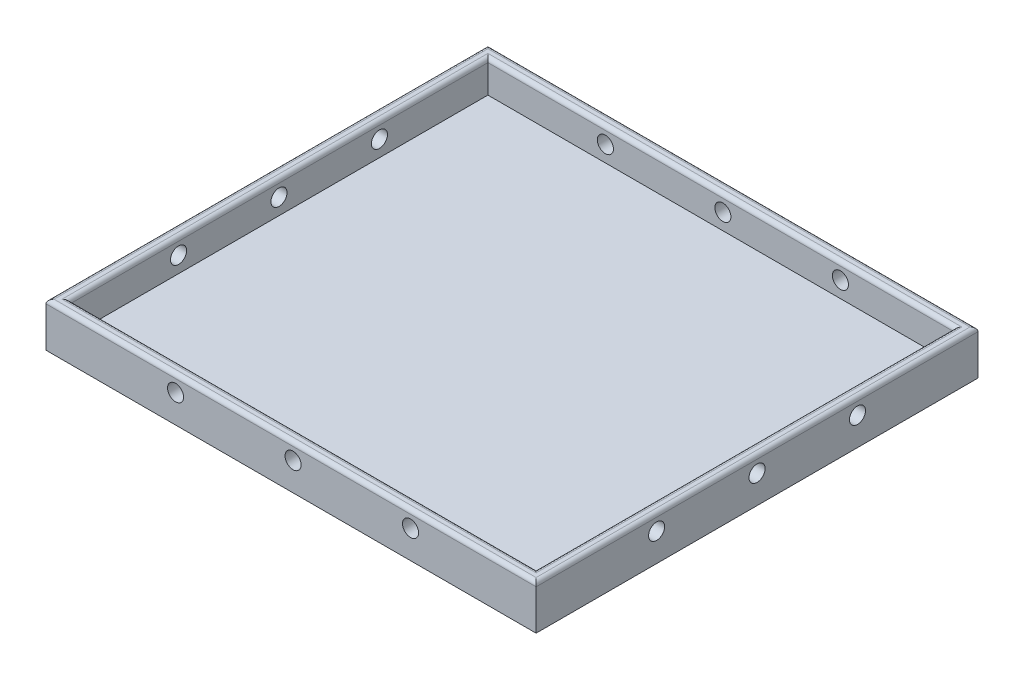
ISO-10303-21;
HEADER;
FILE_DESCRIPTION(('STEP AP214'),'2;1');
FILE_NAME('part.step','',(''),(''),'','','');
FILE_SCHEMA(('AUTOMOTIVE_DESIGN { 1 0 10303 214 1 1 1 1 }'));
ENDSEC;
DATA;
#1=APPLICATION_CONTEXT('core data for automotive mechanical design processes');
#2=APPLICATION_PROTOCOL_DEFINITION('international standard','automotive_design',2000,#1);
#3=PRODUCT_CONTEXT('',#1,'mechanical');
#4=PRODUCT('Part','Part','',(#3));
#5=PRODUCT_RELATED_PRODUCT_CATEGORY('part','',(#4));
#6=PRODUCT_DEFINITION_FORMATION('','',#4);
#7=PRODUCT_DEFINITION_CONTEXT('part definition',#1,'design');
#8=PRODUCT_DEFINITION('design','',#6,#7);
#9=PRODUCT_DEFINITION_SHAPE('','',#8);
#10=(LENGTH_UNIT() NAMED_UNIT(*) SI_UNIT(.MILLI.,.METRE.));
#11=(NAMED_UNIT(*) PLANE_ANGLE_UNIT() SI_UNIT($,.RADIAN.));
#12=(NAMED_UNIT(*) SI_UNIT($,.STERADIAN.) SOLID_ANGLE_UNIT());
#13=UNCERTAINTY_MEASURE_WITH_UNIT(LENGTH_MEASURE(1.E-05),#10,'distance_accuracy_value','');
#14=(GEOMETRIC_REPRESENTATION_CONTEXT(3) GLOBAL_UNCERTAINTY_ASSIGNED_CONTEXT((#13)) GLOBAL_UNIT_ASSIGNED_CONTEXT((#10,
#11,#12)) REPRESENTATION_CONTEXT('',''));
#15=CARTESIAN_POINT('',(0.,0.,0.));
#16=DIRECTION('',(0.,0.,1.));
#17=DIRECTION('',(1.,0.,0.));
#18=AXIS2_PLACEMENT_3D('',#15,#16,#17);
#19=CARTESIAN_POINT('',(-201.609907120743,11.,-77.8947368421052));
#20=DIRECTION('',(1.,0.,0.));
#21=DIRECTION('',(0.,0.,-1.));
#22=AXIS2_PLACEMENT_3D('',#19,#20,#21);
#23=PLANE('',#22);
#24=CARTESIAN_POINT('',(-201.609907120743,6.99999997663109,2.10526315789477));
#25=DIRECTION('',(1.,0.,0.));
#26=DIRECTION('',(0.,0.,-1.));
#27=AXIS2_PLACEMENT_3D('',#24,#25,#26);
#28=CIRCLE('',#27,1.99999999316759);
#29=CARTESIAN_POINT('',(-201.609907120743,6.99999997663109,0.105263164727173));
#30=VERTEX_POINT('',#29);
#31=EDGE_CURVE('E190',#30,#30,#28,.T.);
#32=ORIENTED_EDGE('',*,*,#31,.T.);
#33=EDGE_LOOP('',(#32));
#34=FACE_BOUND('',#33,.T.);
#35=CARTESIAN_POINT('',(-201.609907120743,6.99999997663109,-22.8947368421052));
#36=DIRECTION('',(1.,0.,0.));
#37=DIRECTION('',(0.,0.,-1.));
#38=AXIS2_PLACEMENT_3D('',#35,#36,#37);
#39=CIRCLE('',#38,1.9999999931676);
#40=CARTESIAN_POINT('',(-201.609907120743,6.99999997663109,-24.8947368352728));
#41=VERTEX_POINT('',#40);
#42=EDGE_CURVE('E593',#41,#41,#39,.T.);
#43=ORIENTED_EDGE('',*,*,#42,.T.);
#44=EDGE_LOOP('',(#43));
#45=FACE_BOUND('',#44,.T.);
#46=CARTESIAN_POINT('',(-201.609907120743,7.,-47.8947368421052));
#47=DIRECTION('',(1.,0.,0.));
#48=DIRECTION('',(0.,0.,-1.));
#49=AXIS2_PLACEMENT_3D('',#46,#47,#48);
#50=CIRCLE('',#49,2.);
#51=CARTESIAN_POINT('',(-201.609907120743,7.,-49.8947368421052));
#52=VERTEX_POINT('',#51);
#53=EDGE_CURVE('E586',#52,#52,#50,.T.);
#54=ORIENTED_EDGE('',*,*,#53,.T.);
#55=EDGE_LOOP('',(#54));
#56=FACE_BOUND('',#55,.T.);
#57=DIRECTION('',(0.,-1.,0.));
#58=VECTOR('',#57,1.);
#59=CARTESIAN_POINT('',(-201.609907120743,11.,32.1052631578948));
#60=LINE('',#59,#58);
#61=CARTESIAN_POINT('',(-201.609907120743,10.,32.1052631578948));
#62=VERTEX_POINT('',#61);
#63=CARTESIAN_POINT('',(-201.609907120743,0.,32.1052631578948));
#64=VERTEX_POINT('',#63);
#65=EDGE_CURVE('E183',#62,#64,#60,.T.);
#66=ORIENTED_EDGE('',*,*,#65,.F.);
#67=DIRECTION('',(0.,0.,1.));
#68=VECTOR('',#67,1.);
#69=CARTESIAN_POINT('',(-201.609907120743,10.,-77.8947368421052));
#70=LINE('',#69,#68);
#71=CARTESIAN_POINT('',(-201.609907120743,10.,-77.8947368421052));
#72=VERTEX_POINT('',#71);
#73=EDGE_CURVE('E44',#62,#72,#70,.F.);
#74=ORIENTED_EDGE('',*,*,#73,.T.);
#75=DIRECTION('',(0.,-1.,0.));
#76=VECTOR('',#75,1.);
#77=CARTESIAN_POINT('',(-201.609907120743,11.,-77.8947368421052));
#78=LINE('',#77,#76);
#79=CARTESIAN_POINT('',(-201.609907120743,0.,-77.8947368421052));
#80=VERTEX_POINT('',#79);
#81=EDGE_CURVE('E177',#72,#80,#78,.T.);
#82=ORIENTED_EDGE('',*,*,#81,.T.);
#83=DIRECTION('',(0.,0.,1.));
#84=VECTOR('',#83,1.);
#85=CARTESIAN_POINT('',(-201.609907120743,0.,-77.8947368421052));
#86=LINE('',#85,#84);
#87=EDGE_CURVE('E162',#80,#64,#86,.T.);
#88=ORIENTED_EDGE('',*,*,#87,.T.);
#89=EDGE_LOOP('',(#66,#74,#82,#88));
#90=FACE_BOUND('',#89,.T.);
#91=ADVANCED_FACE('F35',(#34,#45,#56,#90),#23,.F.);
#92=CARTESIAN_POINT('',(-201.609907120743,11.,32.1052631578948));
#93=DIRECTION('',(0.,0.,-1.));
#94=DIRECTION('',(-1.,0.,0.));
#95=AXIS2_PLACEMENT_3D('',#92,#93,#94);
#96=PLANE('',#95);
#97=CARTESIAN_POINT('',(-169.359907120743,7.,32.1052631578948));
#98=DIRECTION('',(0.,0.,1.));
#99=DIRECTION('',(1.,0.,0.));
#100=AXIS2_PLACEMENT_3D('',#97,#98,#99);
#101=CIRCLE('',#100,2.);
#102=CARTESIAN_POINT('',(-167.359907120743,7.,32.1052631578948));
#103=VERTEX_POINT('',#102);
#104=EDGE_CURVE('E621',#103,#103,#101,.T.);
#105=ORIENTED_EDGE('',*,*,#104,.F.);
#106=EDGE_LOOP('',(#105));
#107=FACE_BOUND('',#106,.T.);
#108=CARTESIAN_POINT('',(-140.109907120743,7.,32.1052631578948));
#109=DIRECTION('',(0.,0.,1.));
#110=DIRECTION('',(1.,0.,0.));
#111=AXIS2_PLACEMENT_3D('',#108,#109,#110);
#112=CIRCLE('',#111,2.);
#113=CARTESIAN_POINT('',(-138.109907120743,7.,32.1052631578948));
#114=VERTEX_POINT('',#113);
#115=EDGE_CURVE('E615',#114,#114,#112,.T.);
#116=ORIENTED_EDGE('',*,*,#115,.F.);
#117=EDGE_LOOP('',(#116));
#118=FACE_BOUND('',#117,.T.);
#119=CARTESIAN_POINT('',(-110.859907120743,7.,32.1052631578948));
#120=DIRECTION('',(0.,0.,1.));
#121=DIRECTION('',(1.,0.,0.));
#122=AXIS2_PLACEMENT_3D('',#119,#120,#121);
#123=CIRCLE('',#122,2.);
#124=CARTESIAN_POINT('',(-108.859907120743,7.,32.1052631578948));
#125=VERTEX_POINT('',#124);
#126=EDGE_CURVE('E249',#125,#125,#123,.T.);
#127=ORIENTED_EDGE('',*,*,#126,.F.);
#128=EDGE_LOOP('',(#127));
#129=FACE_BOUND('',#128,.T.);
#130=DIRECTION('',(0.,-1.,0.));
#131=VECTOR('',#130,1.);
#132=CARTESIAN_POINT('',(-79.6099071207431,11.,32.1052631578948));
#133=LINE('',#132,#131);
#134=CARTESIAN_POINT('',(-79.6099071207431,10.,32.1052631578948));
#135=VERTEX_POINT('',#134);
#136=CARTESIAN_POINT('',(-79.6099071207431,0.,32.1052631578948));
#137=VERTEX_POINT('',#136);
#138=EDGE_CURVE('E181',#135,#137,#133,.T.);
#139=ORIENTED_EDGE('',*,*,#138,.F.);
#140=DIRECTION('',(1.,0.,0.));
#141=VECTOR('',#140,1.);
#142=CARTESIAN_POINT('',(-201.609907120743,10.,32.1052631578948));
#143=LINE('',#142,#141);
#144=EDGE_CURVE('E229',#135,#62,#143,.F.);
#145=ORIENTED_EDGE('',*,*,#144,.T.);
#146=ORIENTED_EDGE('',*,*,#65,.T.);
#147=DIRECTION('',(1.,0.,0.));
#148=VECTOR('',#147,1.);
#149=CARTESIAN_POINT('',(-201.609907120743,0.,32.1052631578948));
#150=LINE('',#149,#148);
#151=EDGE_CURVE('E168',#64,#137,#150,.T.);
#152=ORIENTED_EDGE('',*,*,#151,.T.);
#153=EDGE_LOOP('',(#139,#145,#146,#152));
#154=FACE_BOUND('',#153,.T.);
#155=ADVANCED_FACE('F281',(#107,#118,#129,#154),#96,.F.);
#156=CARTESIAN_POINT('',(-79.6099071207431,11.,-77.8947368421052));
#157=DIRECTION('',(-1.,0.,0.));
#158=DIRECTION('',(0.,0.,1.));
#159=AXIS2_PLACEMENT_3D('',#156,#157,#158);
#160=PLANE('',#159);
#161=CARTESIAN_POINT('',(-79.6099071207431,6.99999997663109,2.10526315789477));
#162=DIRECTION('',(1.,0.,0.));
#163=DIRECTION('',(0.,0.,-1.));
#164=AXIS2_PLACEMENT_3D('',#161,#162,#163);
#165=CIRCLE('',#164,1.99999999316759);
#166=CARTESIAN_POINT('',(-79.6099071207431,6.99999997663109,0.105263164727173));
#167=VERTEX_POINT('',#166);
#168=EDGE_CURVE('E578',#167,#167,#165,.T.);
#169=ORIENTED_EDGE('',*,*,#168,.F.);
#170=EDGE_LOOP('',(#169));
#171=FACE_BOUND('',#170,.T.);
#172=CARTESIAN_POINT('',(-79.6099071207431,6.99999997663109,-22.8947368421052));
#173=DIRECTION('',(1.,0.,0.));
#174=DIRECTION('',(0.,0.,-1.));
#175=AXIS2_PLACEMENT_3D('',#172,#173,#174);
#176=CIRCLE('',#175,1.9999999931676);
#177=CARTESIAN_POINT('',(-79.6099071207431,6.99999997663109,-24.8947368352728));
#178=VERTEX_POINT('',#177);
#179=EDGE_CURVE('E582',#178,#178,#176,.T.);
#180=ORIENTED_EDGE('',*,*,#179,.F.);
#181=EDGE_LOOP('',(#180));
#182=FACE_BOUND('',#181,.T.);
#183=CARTESIAN_POINT('',(-79.6099071207431,7.,-47.8947368421052));
#184=DIRECTION('',(1.,0.,0.));
#185=DIRECTION('',(0.,0.,-1.));
#186=AXIS2_PLACEMENT_3D('',#183,#184,#185);
#187=CIRCLE('',#186,2.);
#188=CARTESIAN_POINT('',(-79.6099071207431,7.,-49.8947368421052));
#189=VERTEX_POINT('',#188);
#190=EDGE_CURVE('E585',#189,#189,#187,.T.);
#191=ORIENTED_EDGE('',*,*,#190,.F.);
#192=EDGE_LOOP('',(#191));
#193=FACE_BOUND('',#192,.T.);
#194=DIRECTION('',(0.,-1.,0.));
#195=VECTOR('',#194,1.);
#196=CARTESIAN_POINT('',(-79.6099071207431,11.,-77.8947368421052));
#197=LINE('',#196,#195);
#198=CARTESIAN_POINT('',(-79.6099071207431,10.,-77.8947368421052));
#199=VERTEX_POINT('',#198);
#200=CARTESIAN_POINT('',(-79.6099071207431,0.,-77.8947368421052));
#201=VERTEX_POINT('',#200);
#202=EDGE_CURVE('E179',#199,#201,#197,.T.);
#203=ORIENTED_EDGE('',*,*,#202,.F.);
#204=DIRECTION('',(0.,0.,-1.));
#205=VECTOR('',#204,1.);
#206=CARTESIAN_POINT('',(-79.6099071207431,10.,32.1052631578948));
#207=LINE('',#206,#205);
#208=EDGE_CURVE('E232',#199,#135,#207,.F.);
#209=ORIENTED_EDGE('',*,*,#208,.T.);
#210=ORIENTED_EDGE('',*,*,#138,.T.);
#211=DIRECTION('',(0.,0.,-1.));
#212=VECTOR('',#211,1.);
#213=CARTESIAN_POINT('',(-79.6099071207431,0.,-77.8947368421052));
#214=LINE('',#213,#212);
#215=EDGE_CURVE('E171',#137,#201,#214,.T.);
#216=ORIENTED_EDGE('',*,*,#215,.T.);
#217=EDGE_LOOP('',(#203,#209,#210,#216));
#218=FACE_BOUND('',#217,.T.);
#219=ADVANCED_FACE('F272',(#171,#182,#193,#218),#160,.F.);
#220=CARTESIAN_POINT('',(-201.609907120743,11.,-77.8947368421052));
#221=DIRECTION('',(0.,0.,1.));
#222=DIRECTION('',(1.,0.,0.));
#223=AXIS2_PLACEMENT_3D('',#220,#221,#222);
#224=PLANE('',#223);
#225=CARTESIAN_POINT('',(-169.359907120743,7.,-77.8947368421052));
#226=DIRECTION('',(0.,0.,1.));
#227=DIRECTION('',(1.,0.,0.));
#228=AXIS2_PLACEMENT_3D('',#225,#226,#227);
#229=CIRCLE('',#228,2.);
#230=CARTESIAN_POINT('',(-167.359907120743,7.,-77.8947368421052));
#231=VERTEX_POINT('',#230);
#232=EDGE_CURVE('E201',#231,#231,#229,.T.);
#233=ORIENTED_EDGE('',*,*,#232,.T.);
#234=EDGE_LOOP('',(#233));
#235=FACE_BOUND('',#234,.T.);
#236=CARTESIAN_POINT('',(-140.109907120743,7.,-77.8947368421052));
#237=DIRECTION('',(0.,0.,1.));
#238=DIRECTION('',(1.,0.,0.));
#239=AXIS2_PLACEMENT_3D('',#236,#237,#238);
#240=CIRCLE('',#239,2.);
#241=CARTESIAN_POINT('',(-138.109907120743,7.,-77.8947368421052));
#242=VERTEX_POINT('',#241);
#243=EDGE_CURVE('E618',#242,#242,#240,.T.);
#244=ORIENTED_EDGE('',*,*,#243,.T.);
#245=EDGE_LOOP('',(#244));
#246=FACE_BOUND('',#245,.T.);
#247=CARTESIAN_POINT('',(-110.859907120743,7.,-77.8947368421052));
#248=DIRECTION('',(0.,0.,1.));
#249=DIRECTION('',(1.,0.,0.));
#250=AXIS2_PLACEMENT_3D('',#247,#248,#249);
#251=CIRCLE('',#250,2.);
#252=CARTESIAN_POINT('',(-108.859907120743,7.,-77.8947368421052));
#253=VERTEX_POINT('',#252);
#254=EDGE_CURVE('E612',#253,#253,#251,.T.);
#255=ORIENTED_EDGE('',*,*,#254,.T.);
#256=EDGE_LOOP('',(#255));
#257=FACE_BOUND('',#256,.T.);
#258=ORIENTED_EDGE('',*,*,#81,.F.);
#259=DIRECTION('',(-1.,0.,0.));
#260=VECTOR('',#259,1.);
#261=CARTESIAN_POINT('',(-79.6099071207431,10.,-77.8947368421052));
#262=LINE('',#261,#260);
#263=EDGE_CURVE('E11',#72,#199,#262,.F.);
#264=ORIENTED_EDGE('',*,*,#263,.T.);
#265=ORIENTED_EDGE('',*,*,#202,.T.);
#266=DIRECTION('',(-1.,0.,0.));
#267=VECTOR('',#266,1.);
#268=CARTESIAN_POINT('',(-201.609907120743,0.,-77.8947368421052));
#269=LINE('',#268,#267);
#270=EDGE_CURVE('E174',#201,#80,#269,.T.);
#271=ORIENTED_EDGE('',*,*,#270,.T.);
#272=EDGE_LOOP('',(#258,#264,#265,#271));
#273=FACE_BOUND('',#272,.T.);
#274=ADVANCED_FACE('F270',(#235,#246,#257,#273),#224,.F.);
#275=CARTESIAN_POINT('',(0.,11.,0.));
#276=DIRECTION('',(0.,1.,0.));
#277=DIRECTION('',(0.,0.,1.));
#278=AXIS2_PLACEMENT_3D('',#275,#276,#277);
#279=PLANE('',#278);
#280=DIRECTION('',(0.,0.,-1.));
#281=VECTOR('',#280,1.);
#282=CARTESIAN_POINT('',(-81.6099071207431,11.,29.1052631578948));
#283=LINE('',#282,#281);
#284=CARTESIAN_POINT('',(-81.6099071207431,11.,-75.8947368421052));
#285=VERTEX_POINT('',#284);
#286=CARTESIAN_POINT('',(-81.6099071207431,11.,30.1052631578948));
#287=VERTEX_POINT('',#286);
#288=EDGE_CURVE('E224',#285,#287,#283,.F.);
#289=ORIENTED_EDGE('',*,*,#288,.T.);
#290=DIRECTION('',(1.,0.,0.));
#291=VECTOR('',#290,1.);
#292=CARTESIAN_POINT('',(-198.609907120743,11.,30.1052631578948));
#293=LINE('',#292,#291);
#294=CARTESIAN_POINT('',(-199.609907120743,11.,30.1052631578948));
#295=VERTEX_POINT('',#294);
#296=EDGE_CURVE('E226',#287,#295,#293,.F.);
#297=ORIENTED_EDGE('',*,*,#296,.T.);
#298=DIRECTION('',(0.,0.,1.));
#299=VECTOR('',#298,1.);
#300=CARTESIAN_POINT('',(-199.609907120743,11.,-74.8947368421052));
#301=LINE('',#300,#299);
#302=CARTESIAN_POINT('',(-199.609907120743,11.,-75.8947368421052));
#303=VERTEX_POINT('',#302);
#304=EDGE_CURVE('E222',#295,#303,#301,.F.);
#305=ORIENTED_EDGE('',*,*,#304,.T.);
#306=DIRECTION('',(-1.,0.,0.));
#307=VECTOR('',#306,1.);
#308=CARTESIAN_POINT('',(-82.6099071207431,11.,-75.8947368421052));
#309=LINE('',#308,#307);
#310=EDGE_CURVE('E220',#303,#285,#309,.F.);
#311=ORIENTED_EDGE('',*,*,#310,.T.);
#312=EDGE_LOOP('',(#289,#297,#305,#311));
#313=FACE_BOUND('',#312,.T.);
#314=DIRECTION('',(0.,0.,1.));
#315=VECTOR('',#314,1.);
#316=CARTESIAN_POINT('',(-200.609907120743,11.,32.1052631578948));
#317=LINE('',#316,#315);
#318=CARTESIAN_POINT('',(-200.609907120743,11.,-76.8947368421052));
#319=VERTEX_POINT('',#318);
#320=CARTESIAN_POINT('',(-200.609907120743,11.,31.1052631578948));
#321=VERTEX_POINT('',#320);
#322=EDGE_CURVE('E213',#319,#321,#317,.T.);
#323=ORIENTED_EDGE('',*,*,#322,.T.);
#324=DIRECTION('',(1.,0.,0.));
#325=VECTOR('',#324,1.);
#326=CARTESIAN_POINT('',(-79.6099071207431,11.,31.1052631578948));
#327=LINE('',#326,#325);
#328=CARTESIAN_POINT('',(-80.6099071207431,11.,31.1052631578948));
#329=VERTEX_POINT('',#328);
#330=EDGE_CURVE('E217',#321,#329,#327,.T.);
#331=ORIENTED_EDGE('',*,*,#330,.T.);
#332=DIRECTION('',(0.,0.,-1.));
#333=VECTOR('',#332,1.);
#334=CARTESIAN_POINT('',(-80.6099071207431,11.,-77.8947368421052));
#335=LINE('',#334,#333);
#336=CARTESIAN_POINT('',(-80.6099071207431,11.,-76.8947368421052));
#337=VERTEX_POINT('',#336);
#338=EDGE_CURVE('E215',#329,#337,#335,.T.);
#339=ORIENTED_EDGE('',*,*,#338,.T.);
#340=DIRECTION('',(-1.,0.,0.));
#341=VECTOR('',#340,1.);
#342=CARTESIAN_POINT('',(-201.609907120743,11.,-76.8947368421052));
#343=LINE('',#342,#341);
#344=EDGE_CURVE('E211',#337,#319,#343,.T.);
#345=ORIENTED_EDGE('',*,*,#344,.T.);
#346=EDGE_LOOP('',(#323,#331,#339,#345));
#347=FACE_BOUND('',#346,.T.);
#348=ADVANCED_FACE('F289',(#313,#347),#279,.T.);
#349=CARTESIAN_POINT('',(0.,0.,0.));
#350=DIRECTION('',(0.,1.,0.));
#351=DIRECTION('',(0.,0.,1.));
#352=AXIS2_PLACEMENT_3D('',#349,#350,#351);
#353=PLANE('',#352);
#354=ORIENTED_EDGE('',*,*,#87,.F.);
#355=ORIENTED_EDGE('',*,*,#270,.F.);
#356=ORIENTED_EDGE('',*,*,#215,.F.);
#357=ORIENTED_EDGE('',*,*,#151,.F.);
#358=EDGE_LOOP('',(#354,#355,#356,#357));
#359=FACE_BOUND('',#358,.T.);
#360=ADVANCED_FACE('F279',(#359),#353,.F.);
#361=CARTESIAN_POINT('',(-198.609907120743,3.,-74.8947368421052));
#362=DIRECTION('',(-1.,0.,0.));
#363=DIRECTION('',(0.,0.,1.));
#364=AXIS2_PLACEMENT_3D('',#361,#362,#363);
#365=PLANE('',#364);
#366=CARTESIAN_POINT('',(-198.609907120743,6.99999997663109,2.10526315789477));
#367=DIRECTION('',(-1.,0.,0.));
#368=DIRECTION('',(0.,0.,1.));
#369=AXIS2_PLACEMENT_3D('',#366,#367,#368);
#370=CIRCLE('',#369,1.99999999316759);
#371=CARTESIAN_POINT('',(-198.609907120743,6.99999997663109,4.10526315106236));
#372=VERTEX_POINT('',#371);
#373=EDGE_CURVE('E151',#372,#372,#370,.T.);
#374=ORIENTED_EDGE('',*,*,#373,.T.);
#375=EDGE_LOOP('',(#374));
#376=FACE_BOUND('',#375,.T.);
#377=CARTESIAN_POINT('',(-198.609907120743,6.99999997663109,-22.8947368421052));
#378=DIRECTION('',(-1.,0.,0.));
#379=DIRECTION('',(0.,0.,1.));
#380=AXIS2_PLACEMENT_3D('',#377,#378,#379);
#381=CIRCLE('',#380,1.9999999931676);
#382=CARTESIAN_POINT('',(-198.609907120743,6.99999997663109,-20.8947368489376));
#383=VERTEX_POINT('',#382);
#384=EDGE_CURVE('E194',#383,#383,#381,.T.);
#385=ORIENTED_EDGE('',*,*,#384,.T.);
#386=EDGE_LOOP('',(#385));
#387=FACE_BOUND('',#386,.T.);
#388=CARTESIAN_POINT('',(-198.609907120743,7.,-47.8947368421052));
#389=DIRECTION('',(-1.,0.,0.));
#390=DIRECTION('',(0.,0.,1.));
#391=AXIS2_PLACEMENT_3D('',#388,#389,#390);
#392=CIRCLE('',#391,2.);
#393=CARTESIAN_POINT('',(-198.609907120743,7.,-45.8947368421052));
#394=VERTEX_POINT('',#393);
#395=EDGE_CURVE('E189',#394,#394,#392,.T.);
#396=ORIENTED_EDGE('',*,*,#395,.T.);
#397=EDGE_LOOP('',(#396));
#398=FACE_BOUND('',#397,.T.);
#399=DIRECTION('',(0.,1.,0.));
#400=VECTOR('',#399,1.);
#401=CARTESIAN_POINT('',(-198.609907120743,3.,-74.8947368421052));
#402=LINE('',#401,#400);
#403=CARTESIAN_POINT('',(-198.609907120743,3.,-74.8947368421052));
#404=VERTEX_POINT('',#403);
#405=CARTESIAN_POINT('',(-198.609907120743,10.,-74.8947368421052));
#406=VERTEX_POINT('',#405);
#407=EDGE_CURVE('E160',#404,#406,#402,.T.);
#408=ORIENTED_EDGE('',*,*,#407,.T.);
#409=DIRECTION('',(0.,0.,1.));
#410=VECTOR('',#409,1.);
#411=CARTESIAN_POINT('',(-198.609907120743,10.,29.1052631578948));
#412=LINE('',#411,#410);
#413=CARTESIAN_POINT('',(-198.609907120743,10.,29.1052631578948));
#414=VERTEX_POINT('',#413);
#415=EDGE_CURVE('E133',#406,#414,#412,.T.);
#416=ORIENTED_EDGE('',*,*,#415,.T.);
#417=DIRECTION('',(0.,1.,0.));
#418=VECTOR('',#417,1.);
#419=CARTESIAN_POINT('',(-198.609907120743,3.,29.1052631578948));
#420=LINE('',#419,#418);
#421=CARTESIAN_POINT('',(-198.609907120743,3.,29.1052631578948));
#422=VERTEX_POINT('',#421);
#423=EDGE_CURVE('E126',#422,#414,#420,.T.);
#424=ORIENTED_EDGE('',*,*,#423,.F.);
#425=DIRECTION('',(0.,0.,1.));
#426=VECTOR('',#425,1.);
#427=CARTESIAN_POINT('',(-198.609907120743,3.,-74.8947368421052));
#428=LINE('',#427,#426);
#429=EDGE_CURVE('E130',#404,#422,#428,.T.);
#430=ORIENTED_EDGE('',*,*,#429,.F.);
#431=EDGE_LOOP('',(#408,#416,#424,#430));
#432=FACE_BOUND('',#431,.T.);
#433=ADVANCED_FACE('F128',(#376,#387,#398,#432),#365,.F.);
#434=CARTESIAN_POINT('',(-198.609907120743,3.,-74.8947368421052));
#435=DIRECTION('',(0.,0.,-1.));
#436=DIRECTION('',(-1.,0.,0.));
#437=AXIS2_PLACEMENT_3D('',#434,#435,#436);
#438=PLANE('',#437);
#439=CARTESIAN_POINT('',(-169.359907120743,7.,-74.8947368421052));
#440=DIRECTION('',(0.,0.,-1.));
#441=DIRECTION('',(-1.,0.,0.));
#442=AXIS2_PLACEMENT_3D('',#439,#440,#441);
#443=CIRCLE('',#442,2.);
#444=CARTESIAN_POINT('',(-171.359907120743,7.,-74.8947368421052));
#445=VERTEX_POINT('',#444);
#446=EDGE_CURVE('E209',#445,#445,#443,.T.);
#447=ORIENTED_EDGE('',*,*,#446,.T.);
#448=EDGE_LOOP('',(#447));
#449=FACE_BOUND('',#448,.T.);
#450=CARTESIAN_POINT('',(-140.109907120743,7.,-74.8947368421052));
#451=DIRECTION('',(0.,0.,-1.));
#452=DIRECTION('',(-1.,0.,0.));
#453=AXIS2_PLACEMENT_3D('',#450,#451,#452);
#454=CIRCLE('',#453,2.);
#455=CARTESIAN_POINT('',(-142.109907120743,7.,-74.8947368421052));
#456=VERTEX_POINT('',#455);
#457=EDGE_CURVE('E205',#456,#456,#454,.T.);
#458=ORIENTED_EDGE('',*,*,#457,.T.);
#459=EDGE_LOOP('',(#458));
#460=FACE_BOUND('',#459,.T.);
#461=CARTESIAN_POINT('',(-110.859907120743,7.,-74.8947368421052));
#462=DIRECTION('',(0.,0.,-1.));
#463=DIRECTION('',(-1.,0.,0.));
#464=AXIS2_PLACEMENT_3D('',#461,#462,#463);
#465=CIRCLE('',#464,2.);
#466=CARTESIAN_POINT('',(-112.859907120743,7.,-74.8947368421052));
#467=VERTEX_POINT('',#466);
#468=EDGE_CURVE('E200',#467,#467,#465,.T.);
#469=ORIENTED_EDGE('',*,*,#468,.T.);
#470=EDGE_LOOP('',(#469));
#471=FACE_BOUND('',#470,.T.);
#472=DIRECTION('',(0.,1.,0.));
#473=VECTOR('',#472,1.);
#474=CARTESIAN_POINT('',(-82.6099071207431,3.,-74.8947368421052));
#475=LINE('',#474,#473);
#476=CARTESIAN_POINT('',(-82.6099071207431,3.,-74.8947368421052));
#477=VERTEX_POINT('',#476);
#478=CARTESIAN_POINT('',(-82.6099071207431,10.,-74.8947368421052));
#479=VERTEX_POINT('',#478);
#480=EDGE_CURVE('E163',#477,#479,#475,.T.);
#481=ORIENTED_EDGE('',*,*,#480,.T.);
#482=DIRECTION('',(-1.,0.,0.));
#483=VECTOR('',#482,1.);
#484=CARTESIAN_POINT('',(-198.609907120743,10.,-74.8947368421052));
#485=LINE('',#484,#483);
#486=EDGE_CURVE('E59',#479,#406,#485,.T.);
#487=ORIENTED_EDGE('',*,*,#486,.T.);
#488=ORIENTED_EDGE('',*,*,#407,.F.);
#489=DIRECTION('',(-1.,0.,0.));
#490=VECTOR('',#489,1.);
#491=CARTESIAN_POINT('',(-198.609907120743,3.,-74.8947368421052));
#492=LINE('',#491,#490);
#493=EDGE_CURVE('E138',#477,#404,#492,.T.);
#494=ORIENTED_EDGE('',*,*,#493,.F.);
#495=EDGE_LOOP('',(#481,#487,#488,#494));
#496=FACE_BOUND('',#495,.T.);
#497=ADVANCED_FACE('F465',(#449,#460,#471,#496),#438,.F.);
#498=CARTESIAN_POINT('',(-82.6099071207431,3.,-74.8947368421052));
#499=DIRECTION('',(1.,0.,0.));
#500=DIRECTION('',(0.,0.,-1.));
#501=AXIS2_PLACEMENT_3D('',#498,#499,#500);
#502=PLANE('',#501);
#503=CARTESIAN_POINT('',(-82.6099071207431,6.99999997663109,2.10526315789477));
#504=DIRECTION('',(1.,0.,0.));
#505=DIRECTION('',(0.,0.,-1.));
#506=AXIS2_PLACEMENT_3D('',#503,#504,#505);
#507=CIRCLE('',#506,1.99999999316759);
#508=CARTESIAN_POINT('',(-82.6099071207431,6.99999997663109,0.105263164727173));
#509=VERTEX_POINT('',#508);
#510=EDGE_CURVE('E154',#509,#509,#507,.T.);
#511=ORIENTED_EDGE('',*,*,#510,.T.);
#512=EDGE_LOOP('',(#511));
#513=FACE_BOUND('',#512,.T.);
#514=CARTESIAN_POINT('',(-82.6099071207431,6.99999997663109,-22.8947368421052));
#515=DIRECTION('',(1.,0.,0.));
#516=DIRECTION('',(0.,0.,-1.));
#517=AXIS2_PLACEMENT_3D('',#514,#515,#516);
#518=CIRCLE('',#517,1.9999999931676);
#519=CARTESIAN_POINT('',(-82.6099071207431,6.99999997663109,-24.8947368352728));
#520=VERTEX_POINT('',#519);
#521=EDGE_CURVE('E191',#520,#520,#518,.T.);
#522=ORIENTED_EDGE('',*,*,#521,.T.);
#523=EDGE_LOOP('',(#522));
#524=FACE_BOUND('',#523,.T.);
#525=CARTESIAN_POINT('',(-82.6099071207431,7.,-47.8947368421052));
#526=DIRECTION('',(1.,0.,0.));
#527=DIRECTION('',(0.,0.,-1.));
#528=AXIS2_PLACEMENT_3D('',#525,#526,#527);
#529=CIRCLE('',#528,2.);
#530=CARTESIAN_POINT('',(-82.6099071207431,7.,-49.8947368421052));
#531=VERTEX_POINT('',#530);
#532=EDGE_CURVE('E186',#531,#531,#529,.T.);
#533=ORIENTED_EDGE('',*,*,#532,.T.);
#534=EDGE_LOOP('',(#533));
#535=FACE_BOUND('',#534,.T.);
#536=DIRECTION('',(0.,1.,0.));
#537=VECTOR('',#536,1.);
#538=CARTESIAN_POINT('',(-82.6099071207431,3.,29.1052631578948));
#539=LINE('',#538,#537);
#540=CARTESIAN_POINT('',(-82.6099071207431,3.,29.1052631578948));
#541=VERTEX_POINT('',#540);
#542=CARTESIAN_POINT('',(-82.6099071207431,10.,29.1052631578948));
#543=VERTEX_POINT('',#542);
#544=EDGE_CURVE('E137',#541,#543,#539,.T.);
#545=ORIENTED_EDGE('',*,*,#544,.T.);
#546=DIRECTION('',(0.,0.,-1.));
#547=VECTOR('',#546,1.);
#548=CARTESIAN_POINT('',(-82.6099071207431,10.,-74.8947368421052));
#549=LINE('',#548,#547);
#550=EDGE_CURVE('E234',#543,#479,#549,.T.);
#551=ORIENTED_EDGE('',*,*,#550,.T.);
#552=ORIENTED_EDGE('',*,*,#480,.F.);
#553=DIRECTION('',(0.,0.,-1.));
#554=VECTOR('',#553,1.);
#555=CARTESIAN_POINT('',(-82.6099071207431,3.,-74.8947368421052));
#556=LINE('',#555,#554);
#557=EDGE_CURVE('E147',#541,#477,#556,.T.);
#558=ORIENTED_EDGE('',*,*,#557,.F.);
#559=EDGE_LOOP('',(#545,#551,#552,#558));
#560=FACE_BOUND('',#559,.T.);
#561=ADVANCED_FACE('F457',(#513,#524,#535,#560),#502,.F.);
#562=CARTESIAN_POINT('',(-198.609907120743,3.,29.1052631578948));
#563=DIRECTION('',(0.,0.,1.));
#564=DIRECTION('',(1.,0.,0.));
#565=AXIS2_PLACEMENT_3D('',#562,#563,#564);
#566=PLANE('',#565);
#567=CARTESIAN_POINT('',(-169.359907120743,7.,29.1052631578948));
#568=DIRECTION('',(0.,0.,1.));
#569=DIRECTION('',(1.,0.,0.));
#570=AXIS2_PLACEMENT_3D('',#567,#568,#569);
#571=CIRCLE('',#570,2.);
#572=CARTESIAN_POINT('',(-167.359907120743,7.,29.1052631578948));
#573=VERTEX_POINT('',#572);
#574=EDGE_CURVE('E206',#573,#573,#571,.T.);
#575=ORIENTED_EDGE('',*,*,#574,.T.);
#576=EDGE_LOOP('',(#575));
#577=FACE_BOUND('',#576,.T.);
#578=CARTESIAN_POINT('',(-140.109907120743,7.,29.1052631578948));
#579=DIRECTION('',(0.,0.,1.));
#580=DIRECTION('',(1.,0.,0.));
#581=AXIS2_PLACEMENT_3D('',#578,#579,#580);
#582=CIRCLE('',#581,2.);
#583=CARTESIAN_POINT('',(-138.109907120743,7.,29.1052631578948));
#584=VERTEX_POINT('',#583);
#585=EDGE_CURVE('E202',#584,#584,#582,.T.);
#586=ORIENTED_EDGE('',*,*,#585,.T.);
#587=EDGE_LOOP('',(#586));
#588=FACE_BOUND('',#587,.T.);
#589=CARTESIAN_POINT('',(-110.859907120743,7.,29.1052631578948));
#590=DIRECTION('',(0.,0.,1.));
#591=DIRECTION('',(1.,0.,0.));
#592=AXIS2_PLACEMENT_3D('',#589,#590,#591);
#593=CIRCLE('',#592,2.);
#594=CARTESIAN_POINT('',(-108.859907120743,7.,29.1052631578948));
#595=VERTEX_POINT('',#594);
#596=EDGE_CURVE('E197',#595,#595,#593,.T.);
#597=ORIENTED_EDGE('',*,*,#596,.T.);
#598=EDGE_LOOP('',(#597));
#599=FACE_BOUND('',#598,.T.);
#600=ORIENTED_EDGE('',*,*,#423,.T.);
#601=DIRECTION('',(1.,0.,0.));
#602=VECTOR('',#601,1.);
#603=CARTESIAN_POINT('',(-82.6099071207431,10.,29.1052631578948));
#604=LINE('',#603,#602);
#605=EDGE_CURVE('E185',#414,#543,#604,.T.);
#606=ORIENTED_EDGE('',*,*,#605,.T.);
#607=ORIENTED_EDGE('',*,*,#544,.F.);
#608=DIRECTION('',(1.,0.,0.));
#609=VECTOR('',#608,1.);
#610=CARTESIAN_POINT('',(-198.609907120743,3.,29.1052631578948));
#611=LINE('',#610,#609);
#612=EDGE_CURVE('E141',#422,#541,#611,.T.);
#613=ORIENTED_EDGE('',*,*,#612,.F.);
#614=EDGE_LOOP('',(#600,#606,#607,#613));
#615=FACE_BOUND('',#614,.T.);
#616=ADVANCED_FACE('F142',(#577,#588,#599,#615),#566,.F.);
#617=CARTESIAN_POINT('',(0.,3.,0.));
#618=DIRECTION('',(0.,1.,0.));
#619=DIRECTION('',(0.,0.,1.));
#620=AXIS2_PLACEMENT_3D('',#617,#618,#619);
#621=PLANE('',#620);
#622=ORIENTED_EDGE('',*,*,#429,.T.);
#623=ORIENTED_EDGE('',*,*,#612,.T.);
#624=ORIENTED_EDGE('',*,*,#557,.T.);
#625=ORIENTED_EDGE('',*,*,#493,.T.);
#626=EDGE_LOOP('',(#622,#623,#624,#625));
#627=FACE_BOUND('',#626,.T.);
#628=ADVANCED_FACE('F149',(#627),#621,.T.);
#629=CARTESIAN_POINT('',(-201.609907120743,7.,-47.8947368421052));
#630=DIRECTION('',(1.,0.,0.));
#631=DIRECTION('',(0.,0.,-1.));
#632=AXIS2_PLACEMENT_3D('',#629,#630,#631);
#633=CYLINDRICAL_SURFACE('',#632,2.);
#634=ORIENTED_EDGE('',*,*,#190,.T.);
#635=EDGE_LOOP('',(#634));
#636=FACE_BOUND('',#635,.T.);
#637=ORIENTED_EDGE('',*,*,#532,.F.);
#638=EDGE_LOOP('',(#637));
#639=FACE_BOUND('',#638,.T.);
#640=ADVANCED_FACE('F427',(#636,#639),#633,.F.);
#641=CARTESIAN_POINT('',(-201.609907120743,6.99999997663109,-22.8947368421052));
#642=DIRECTION('',(1.,0.,0.));
#643=DIRECTION('',(0.,0.,-1.));
#644=AXIS2_PLACEMENT_3D('',#641,#642,#643);
#645=CYLINDRICAL_SURFACE('',#644,1.9999999931676);
#646=ORIENTED_EDGE('',*,*,#179,.T.);
#647=EDGE_LOOP('',(#646));
#648=FACE_BOUND('',#647,.T.);
#649=ORIENTED_EDGE('',*,*,#521,.F.);
#650=EDGE_LOOP('',(#649));
#651=FACE_BOUND('',#650,.T.);
#652=ADVANCED_FACE('F419',(#648,#651),#645,.F.);
#653=CARTESIAN_POINT('',(-201.609907120743,6.99999997663109,2.10526315789477));
#654=DIRECTION('',(1.,0.,0.));
#655=DIRECTION('',(0.,0.,-1.));
#656=AXIS2_PLACEMENT_3D('',#653,#654,#655);
#657=CYLINDRICAL_SURFACE('',#656,1.99999999316759);
#658=ORIENTED_EDGE('',*,*,#168,.T.);
#659=EDGE_LOOP('',(#658));
#660=FACE_BOUND('',#659,.T.);
#661=ORIENTED_EDGE('',*,*,#510,.F.);
#662=EDGE_LOOP('',(#661));
#663=FACE_BOUND('',#662,.T.);
#664=ADVANCED_FACE('F410',(#660,#663),#657,.F.);
#665=ORIENTED_EDGE('',*,*,#53,.F.);
#666=EDGE_LOOP('',(#665));
#667=FACE_BOUND('',#666,.T.);
#668=ORIENTED_EDGE('',*,*,#395,.F.);
#669=EDGE_LOOP('',(#668));
#670=FACE_BOUND('',#669,.T.);
#671=ADVANCED_FACE('F416',(#667,#670),#633,.F.);
#672=ORIENTED_EDGE('',*,*,#42,.F.);
#673=EDGE_LOOP('',(#672));
#674=FACE_BOUND('',#673,.T.);
#675=ORIENTED_EDGE('',*,*,#384,.F.);
#676=EDGE_LOOP('',(#675));
#677=FACE_BOUND('',#676,.T.);
#678=ADVANCED_FACE('F407',(#674,#677),#645,.F.);
#679=ORIENTED_EDGE('',*,*,#31,.F.);
#680=EDGE_LOOP('',(#679));
#681=FACE_BOUND('',#680,.T.);
#682=ORIENTED_EDGE('',*,*,#373,.F.);
#683=EDGE_LOOP('',(#682));
#684=FACE_BOUND('',#683,.T.);
#685=ADVANCED_FACE('F400',(#681,#684),#657,.F.);
#686=CARTESIAN_POINT('',(-110.859907120743,7.,-77.8947368421052));
#687=DIRECTION('',(0.,0.,1.));
#688=DIRECTION('',(1.,0.,0.));
#689=AXIS2_PLACEMENT_3D('',#686,#687,#688);
#690=CYLINDRICAL_SURFACE('',#689,2.);
#691=ORIENTED_EDGE('',*,*,#126,.T.);
#692=EDGE_LOOP('',(#691));
#693=FACE_BOUND('',#692,.T.);
#694=ORIENTED_EDGE('',*,*,#596,.F.);
#695=EDGE_LOOP('',(#694));
#696=FACE_BOUND('',#695,.T.);
#697=ADVANCED_FACE('F382',(#693,#696),#690,.F.);
#698=CARTESIAN_POINT('',(-140.109907120743,7.,-77.8947368421052));
#699=DIRECTION('',(0.,0.,1.));
#700=DIRECTION('',(1.,0.,0.));
#701=AXIS2_PLACEMENT_3D('',#698,#699,#700);
#702=CYLINDRICAL_SURFACE('',#701,2.);
#703=ORIENTED_EDGE('',*,*,#115,.T.);
#704=EDGE_LOOP('',(#703));
#705=FACE_BOUND('',#704,.T.);
#706=ORIENTED_EDGE('',*,*,#585,.F.);
#707=EDGE_LOOP('',(#706));
#708=FACE_BOUND('',#707,.T.);
#709=ADVANCED_FACE('F374',(#705,#708),#702,.F.);
#710=CARTESIAN_POINT('',(-169.359907120743,7.,-77.8947368421052));
#711=DIRECTION('',(0.,0.,1.));
#712=DIRECTION('',(1.,0.,0.));
#713=AXIS2_PLACEMENT_3D('',#710,#711,#712);
#714=CYLINDRICAL_SURFACE('',#713,2.);
#715=ORIENTED_EDGE('',*,*,#104,.T.);
#716=EDGE_LOOP('',(#715));
#717=FACE_BOUND('',#716,.T.);
#718=ORIENTED_EDGE('',*,*,#574,.F.);
#719=EDGE_LOOP('',(#718));
#720=FACE_BOUND('',#719,.T.);
#721=ADVANCED_FACE('F365',(#717,#720),#714,.F.);
#722=ORIENTED_EDGE('',*,*,#254,.F.);
#723=EDGE_LOOP('',(#722));
#724=FACE_BOUND('',#723,.T.);
#725=ORIENTED_EDGE('',*,*,#468,.F.);
#726=EDGE_LOOP('',(#725));
#727=FACE_BOUND('',#726,.T.);
#728=ADVANCED_FACE('F371',(#724,#727),#690,.F.);
#729=ORIENTED_EDGE('',*,*,#243,.F.);
#730=EDGE_LOOP('',(#729));
#731=FACE_BOUND('',#730,.T.);
#732=ORIENTED_EDGE('',*,*,#457,.F.);
#733=EDGE_LOOP('',(#732));
#734=FACE_BOUND('',#733,.T.);
#735=ADVANCED_FACE('F362',(#731,#734),#702,.F.);
#736=ORIENTED_EDGE('',*,*,#232,.F.);
#737=EDGE_LOOP('',(#736));
#738=FACE_BOUND('',#737,.T.);
#739=ORIENTED_EDGE('',*,*,#446,.F.);
#740=EDGE_LOOP('',(#739));
#741=FACE_BOUND('',#740,.T.);
#742=ADVANCED_FACE('F328',(#738,#741),#714,.F.);
#743=CARTESIAN_POINT('',(-198.609907120743,10.,-75.8947368421052));
#744=DIRECTION('',(1.,0.,0.));
#745=DIRECTION('',(0.,0.,-1.));
#746=AXIS2_PLACEMENT_3D('',#743,#744,#745);
#747=CYLINDRICAL_SURFACE('',#746,1.);
#748=CARTESIAN_POINT('',(-81.6099071207431,10.,-75.8947368421052));
#749=DIRECTION('',(0.707106781186548,0.,0.707106781186547));
#750=DIRECTION('',(-0.707106781186547,0.,0.707106781186548));
#751=AXIS2_PLACEMENT_3D('',#748,#749,#750);
#752=ELLIPSE('',#751,1.41421356237309,1.);
#753=EDGE_CURVE('E243',#285,#479,#752,.T.);
#754=ORIENTED_EDGE('',*,*,#753,.F.);
#755=ORIENTED_EDGE('',*,*,#310,.F.);
#756=CARTESIAN_POINT('',(-199.609907120743,10.,-75.8947368421052));
#757=DIRECTION('',(0.707106781186547,0.,-0.707106781186547));
#758=DIRECTION('',(-0.707106781186547,0.,-0.707106781186547));
#759=AXIS2_PLACEMENT_3D('',#756,#757,#758);
#760=ELLIPSE('',#759,1.41421356237309,1.);
#761=EDGE_CURVE('E246',#406,#303,#760,.F.);
#762=ORIENTED_EDGE('',*,*,#761,.F.);
#763=ORIENTED_EDGE('',*,*,#486,.F.);
#764=EDGE_LOOP('',(#754,#755,#762,#763));
#765=FACE_BOUND('',#764,.T.);
#766=ADVANCED_FACE('F324',(#765),#747,.T.);
#767=CARTESIAN_POINT('',(-199.609907120743,10.,-74.8947368421052));
#768=DIRECTION('',(0.,0.,-1.));
#769=DIRECTION('',(-1.,0.,0.));
#770=AXIS2_PLACEMENT_3D('',#767,#768,#769);
#771=CYLINDRICAL_SURFACE('',#770,1.);
#772=ORIENTED_EDGE('',*,*,#761,.T.);
#773=ORIENTED_EDGE('',*,*,#304,.F.);
#774=CARTESIAN_POINT('',(-199.609907120743,10.,30.1052631578948));
#775=DIRECTION('',(-0.707106781186547,0.,-0.707106781186547));
#776=DIRECTION('',(-0.707106781186547,0.,0.707106781186547));
#777=AXIS2_PLACEMENT_3D('',#774,#775,#776);
#778=ELLIPSE('',#777,1.41421356237309,1.);
#779=EDGE_CURVE('E241',#414,#295,#778,.F.);
#780=ORIENTED_EDGE('',*,*,#779,.F.);
#781=ORIENTED_EDGE('',*,*,#415,.F.);
#782=EDGE_LOOP('',(#772,#773,#780,#781));
#783=FACE_BOUND('',#782,.T.);
#784=ADVANCED_FACE('F320',(#783),#771,.T.);
#785=CARTESIAN_POINT('',(-81.6099071207431,10.,-74.8947368421052));
#786=DIRECTION('',(0.,0.,1.));
#787=DIRECTION('',(1.,0.,0.));
#788=AXIS2_PLACEMENT_3D('',#785,#786,#787);
#789=CYLINDRICAL_SURFACE('',#788,1.);
#790=ORIENTED_EDGE('',*,*,#753,.T.);
#791=ORIENTED_EDGE('',*,*,#550,.F.);
#792=CARTESIAN_POINT('',(-81.6099071207431,10.,30.1052631578948));
#793=DIRECTION('',(-0.707106781186547,0.,0.707106781186548));
#794=DIRECTION('',(-0.707106781186548,0.,-0.707106781186547));
#795=AXIS2_PLACEMENT_3D('',#792,#793,#794);
#796=ELLIPSE('',#795,1.4142135623731,1.);
#797=EDGE_CURVE('E239',#287,#543,#796,.T.);
#798=ORIENTED_EDGE('',*,*,#797,.F.);
#799=ORIENTED_EDGE('',*,*,#288,.F.);
#800=EDGE_LOOP('',(#790,#791,#798,#799));
#801=FACE_BOUND('',#800,.T.);
#802=ADVANCED_FACE('F316',(#801),#789,.T.);
#803=CARTESIAN_POINT('',(-198.609907120743,10.,30.1052631578948));
#804=DIRECTION('',(-1.,0.,0.));
#805=DIRECTION('',(0.,0.,1.));
#806=AXIS2_PLACEMENT_3D('',#803,#804,#805);
#807=CYLINDRICAL_SURFACE('',#806,1.);
#808=ORIENTED_EDGE('',*,*,#779,.T.);
#809=ORIENTED_EDGE('',*,*,#296,.F.);
#810=ORIENTED_EDGE('',*,*,#797,.T.);
#811=ORIENTED_EDGE('',*,*,#605,.F.);
#812=EDGE_LOOP('',(#808,#809,#810,#811));
#813=FACE_BOUND('',#812,.T.);
#814=ADVANCED_FACE('F313',(#813),#807,.T.);
#815=CARTESIAN_POINT('',(0.,10.,-76.8947368421052));
#816=DIRECTION('',(1.,0.,0.));
#817=DIRECTION('',(0.,0.,-1.));
#818=AXIS2_PLACEMENT_3D('',#815,#816,#817);
#819=CYLINDRICAL_SURFACE('',#818,1.);
#820=CARTESIAN_POINT('',(-80.6099071207431,10.,-76.8947368421052));
#821=DIRECTION('',(0.707106781186548,0.,0.707106781186547));
#822=DIRECTION('',(0.707106781186547,0.,-0.707106781186548));
#823=AXIS2_PLACEMENT_3D('',#820,#821,#822);
#824=ELLIPSE('',#823,1.41421356237309,1.);
#825=EDGE_CURVE('E253',#199,#337,#824,.T.);
#826=ORIENTED_EDGE('',*,*,#825,.F.);
#827=ORIENTED_EDGE('',*,*,#263,.F.);
#828=CARTESIAN_POINT('',(-200.609907120743,10.,-76.8947368421052));
#829=DIRECTION('',(0.707106781186547,0.,-0.707106781186547));
#830=DIRECTION('',(0.707106781186547,0.,0.707106781186547));
#831=AXIS2_PLACEMENT_3D('',#828,#829,#830);
#832=ELLIPSE('',#831,1.41421356237309,1.);
#833=EDGE_CURVE('E39',#319,#72,#832,.F.);
#834=ORIENTED_EDGE('',*,*,#833,.F.);
#835=ORIENTED_EDGE('',*,*,#344,.F.);
#836=EDGE_LOOP('',(#826,#827,#834,#835));
#837=FACE_BOUND('',#836,.T.);
#838=ADVANCED_FACE('F37',(#837),#819,.T.);
#839=CARTESIAN_POINT('',(-200.609907120743,10.,0.));
#840=DIRECTION('',(0.,0.,-1.));
#841=DIRECTION('',(-1.,0.,0.));
#842=AXIS2_PLACEMENT_3D('',#839,#840,#841);
#843=CYLINDRICAL_SURFACE('',#842,1.);
#844=ORIENTED_EDGE('',*,*,#833,.T.);
#845=ORIENTED_EDGE('',*,*,#73,.F.);
#846=CARTESIAN_POINT('',(-200.609907120743,10.,31.1052631578948));
#847=DIRECTION('',(-0.707106781186547,0.,-0.707106781186547));
#848=DIRECTION('',(0.707106781186547,0.,-0.707106781186547));
#849=AXIS2_PLACEMENT_3D('',#846,#847,#848);
#850=ELLIPSE('',#849,1.41421356237309,1.);
#851=EDGE_CURVE('E252',#321,#62,#850,.F.);
#852=ORIENTED_EDGE('',*,*,#851,.F.);
#853=ORIENTED_EDGE('',*,*,#322,.F.);
#854=EDGE_LOOP('',(#844,#845,#852,#853));
#855=FACE_BOUND('',#854,.T.);
#856=ADVANCED_FACE('F263',(#855),#843,.T.);
#857=CARTESIAN_POINT('',(-80.6099071207431,10.,0.));
#858=DIRECTION('',(0.,0.,1.));
#859=DIRECTION('',(1.,0.,0.));
#860=AXIS2_PLACEMENT_3D('',#857,#858,#859);
#861=CYLINDRICAL_SURFACE('',#860,1.);
#862=ORIENTED_EDGE('',*,*,#825,.T.);
#863=ORIENTED_EDGE('',*,*,#338,.F.);
#864=CARTESIAN_POINT('',(-80.6099071207431,10.,31.1052631578948));
#865=DIRECTION('',(-0.707106781186547,0.,0.707106781186548));
#866=DIRECTION('',(0.707106781186548,0.,0.707106781186547));
#867=AXIS2_PLACEMENT_3D('',#864,#865,#866);
#868=ELLIPSE('',#867,1.4142135623731,1.);
#869=EDGE_CURVE('E250',#135,#329,#868,.T.);
#870=ORIENTED_EDGE('',*,*,#869,.F.);
#871=ORIENTED_EDGE('',*,*,#208,.F.);
#872=EDGE_LOOP('',(#862,#863,#870,#871));
#873=FACE_BOUND('',#872,.T.);
#874=ADVANCED_FACE('F287',(#873),#861,.T.);
#875=CARTESIAN_POINT('',(0.,10.,31.1052631578948));
#876=DIRECTION('',(-1.,0.,0.));
#877=DIRECTION('',(0.,0.,1.));
#878=AXIS2_PLACEMENT_3D('',#875,#876,#877);
#879=CYLINDRICAL_SURFACE('',#878,1.);
#880=ORIENTED_EDGE('',*,*,#851,.T.);
#881=ORIENTED_EDGE('',*,*,#144,.F.);
#882=ORIENTED_EDGE('',*,*,#869,.T.);
#883=ORIENTED_EDGE('',*,*,#330,.F.);
#884=EDGE_LOOP('',(#880,#881,#882,#883));
#885=FACE_BOUND('',#884,.T.);
#886=ADVANCED_FACE('F285',(#885),#879,.T.);
#887=CLOSED_SHELL('',(#91,#155,#219,#274,#348,#360,#433,#497,#561,#616,#628,#640,#652,#664,#671,
#678,#685,#697,#709,#721,#728,#735,#742,#766,#784,#802,#814,#838,#856,#874,#886));
#888=MANIFOLD_SOLID_BREP('B2',#887);
#889=ADVANCED_BREP_SHAPE_REPRESENTATION('',(#18,#888),#14);
#890=SHAPE_DEFINITION_REPRESENTATION(#9,#889);
ENDSEC;
END-ISO-10303-21;
